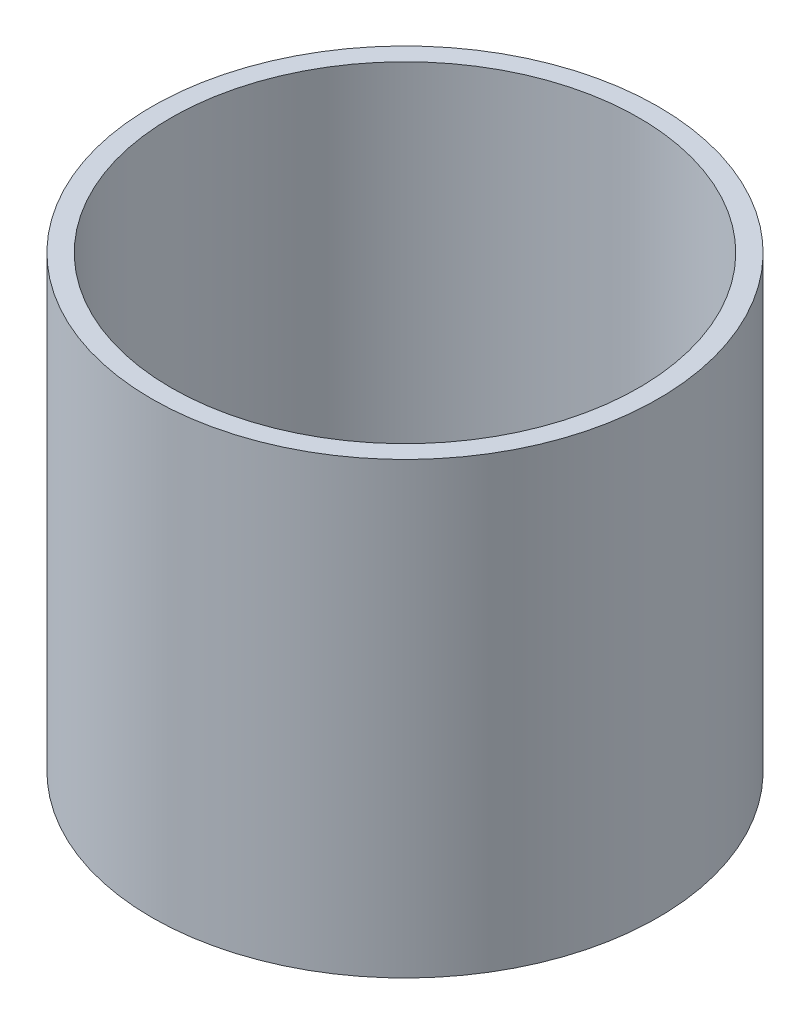
ISO-10303-21;
HEADER;
FILE_DESCRIPTION(('STEP AP214'),'2;1');
FILE_NAME('part.step','',(''),(''),'','','');
FILE_SCHEMA(('AUTOMOTIVE_DESIGN { 1 0 10303 214 1 1 1 1 }'));
ENDSEC;
DATA;
#1=APPLICATION_CONTEXT('core data for automotive mechanical design processes');
#2=APPLICATION_PROTOCOL_DEFINITION('international standard','automotive_design',2000,#1);
#3=PRODUCT_CONTEXT('',#1,'mechanical');
#4=PRODUCT('Part','Part','',(#3));
#5=PRODUCT_RELATED_PRODUCT_CATEGORY('part','',(#4));
#6=PRODUCT_DEFINITION_FORMATION('','',#4);
#7=PRODUCT_DEFINITION_CONTEXT('part definition',#1,'design');
#8=PRODUCT_DEFINITION('design','',#6,#7);
#9=PRODUCT_DEFINITION_SHAPE('','',#8);
#10=(LENGTH_UNIT() NAMED_UNIT(*) SI_UNIT(.MILLI.,.METRE.));
#11=(NAMED_UNIT(*) PLANE_ANGLE_UNIT() SI_UNIT($,.RADIAN.));
#12=(NAMED_UNIT(*) SI_UNIT($,.STERADIAN.) SOLID_ANGLE_UNIT());
#13=UNCERTAINTY_MEASURE_WITH_UNIT(LENGTH_MEASURE(1.E-05),#10,'distance_accuracy_value','');
#14=(GEOMETRIC_REPRESENTATION_CONTEXT(3) GLOBAL_UNCERTAINTY_ASSIGNED_CONTEXT((#13)) GLOBAL_UNIT_ASSIGNED_CONTEXT((#10,
#11,#12)) REPRESENTATION_CONTEXT('',''));
#15=CARTESIAN_POINT('',(0.,0.,0.));
#16=DIRECTION('',(0.,0.,1.));
#17=DIRECTION('',(1.,0.,0.));
#18=AXIS2_PLACEMENT_3D('',#15,#16,#17);
#19=CARTESIAN_POINT('',(0.,0.,0.));
#20=DIRECTION('',(0.,1.,0.));
#21=DIRECTION('',(0.,0.,1.));
#22=AXIS2_PLACEMENT_3D('',#19,#20,#21);
#23=CYLINDRICAL_SURFACE('',#22,9.525);
#24=CARTESIAN_POINT('',(0.,18.288,0.));
#25=DIRECTION('',(0.,1.,0.));
#26=DIRECTION('',(0.,0.,1.));
#27=AXIS2_PLACEMENT_3D('',#24,#25,#26);
#28=CIRCLE('',#27,9.525);
#29=CARTESIAN_POINT('',(0.,18.288,9.525));
#30=VERTEX_POINT('',#29);
#31=EDGE_CURVE('E18',#30,#30,#28,.F.);
#32=ORIENTED_EDGE('',*,*,#31,.F.);
#33=EDGE_LOOP('',(#32));
#34=FACE_BOUND('',#33,.T.);
#35=CARTESIAN_POINT('',(0.,0.,0.));
#36=DIRECTION('',(0.,1.,0.));
#37=DIRECTION('',(0.,0.,1.));
#38=AXIS2_PLACEMENT_3D('',#35,#36,#37);
#39=CIRCLE('',#38,9.525);
#40=CARTESIAN_POINT('',(0.,0.,9.525));
#41=VERTEX_POINT('',#40);
#42=EDGE_CURVE('E27',#41,#41,#39,.T.);
#43=ORIENTED_EDGE('',*,*,#42,.F.);
#44=EDGE_LOOP('',(#43));
#45=FACE_BOUND('',#44,.T.);
#46=ADVANCED_FACE('F15',(#34,#45),#23,.F.);
#47=CARTESIAN_POINT('',(10.3124,18.288,0.));
#48=DIRECTION('',(0.,1.,0.));
#49=DIRECTION('',(0.,0.,1.));
#50=AXIS2_PLACEMENT_3D('',#47,#48,#49);
#51=PLANE('',#50);
#52=CARTESIAN_POINT('',(0.,18.288,0.));
#53=DIRECTION('',(0.,1.,0.));
#54=DIRECTION('',(0.,0.,1.));
#55=AXIS2_PLACEMENT_3D('',#52,#53,#54);
#56=CIRCLE('',#55,10.3124);
#57=CARTESIAN_POINT('',(0.,18.288,10.3124));
#58=VERTEX_POINT('',#57);
#59=EDGE_CURVE('E22',#58,#58,#56,.F.);
#60=ORIENTED_EDGE('',*,*,#59,.F.);
#61=EDGE_LOOP('',(#60));
#62=FACE_BOUND('',#61,.T.);
#63=ORIENTED_EDGE('',*,*,#31,.T.);
#64=EDGE_LOOP('',(#63));
#65=FACE_BOUND('',#64,.T.);
#66=ADVANCED_FACE('F35',(#62,#65),#51,.T.);
#67=CARTESIAN_POINT('',(9.525,0.,0.));
#68=DIRECTION('',(0.,-1.,0.));
#69=DIRECTION('',(0.,0.,-1.));
#70=AXIS2_PLACEMENT_3D('',#67,#68,#69);
#71=PLANE('',#70);
#72=ORIENTED_EDGE('',*,*,#42,.T.);
#73=EDGE_LOOP('',(#72));
#74=FACE_BOUND('',#73,.T.);
#75=CARTESIAN_POINT('',(0.,0.,0.));
#76=DIRECTION('',(0.,1.,0.));
#77=DIRECTION('',(0.,0.,1.));
#78=AXIS2_PLACEMENT_3D('',#75,#76,#77);
#79=CIRCLE('',#78,10.3124);
#80=CARTESIAN_POINT('',(0.,0.,10.3124));
#81=VERTEX_POINT('',#80);
#82=EDGE_CURVE('E10',#81,#81,#79,.T.);
#83=ORIENTED_EDGE('',*,*,#82,.F.);
#84=EDGE_LOOP('',(#83));
#85=FACE_BOUND('',#84,.T.);
#86=ADVANCED_FACE('F43',(#74,#85),#71,.T.);
#87=CARTESIAN_POINT('',(0.,0.,0.));
#88=DIRECTION('',(0.,1.,0.));
#89=DIRECTION('',(0.,0.,1.));
#90=AXIS2_PLACEMENT_3D('',#87,#88,#89);
#91=CYLINDRICAL_SURFACE('',#90,10.3124);
#92=ORIENTED_EDGE('',*,*,#82,.T.);
#93=EDGE_LOOP('',(#92));
#94=FACE_BOUND('',#93,.T.);
#95=ORIENTED_EDGE('',*,*,#59,.T.);
#96=EDGE_LOOP('',(#95));
#97=FACE_BOUND('',#96,.T.);
#98=ADVANCED_FACE('F45',(#94,#97),#91,.T.);
#99=CLOSED_SHELL('',(#46,#66,#86,#98));
#100=MANIFOLD_SOLID_BREP('B1',#99);
#101=ADVANCED_BREP_SHAPE_REPRESENTATION('',(#18,#100),#14);
#102=SHAPE_DEFINITION_REPRESENTATION(#9,#101);
ENDSEC;
END-ISO-10303-21;
